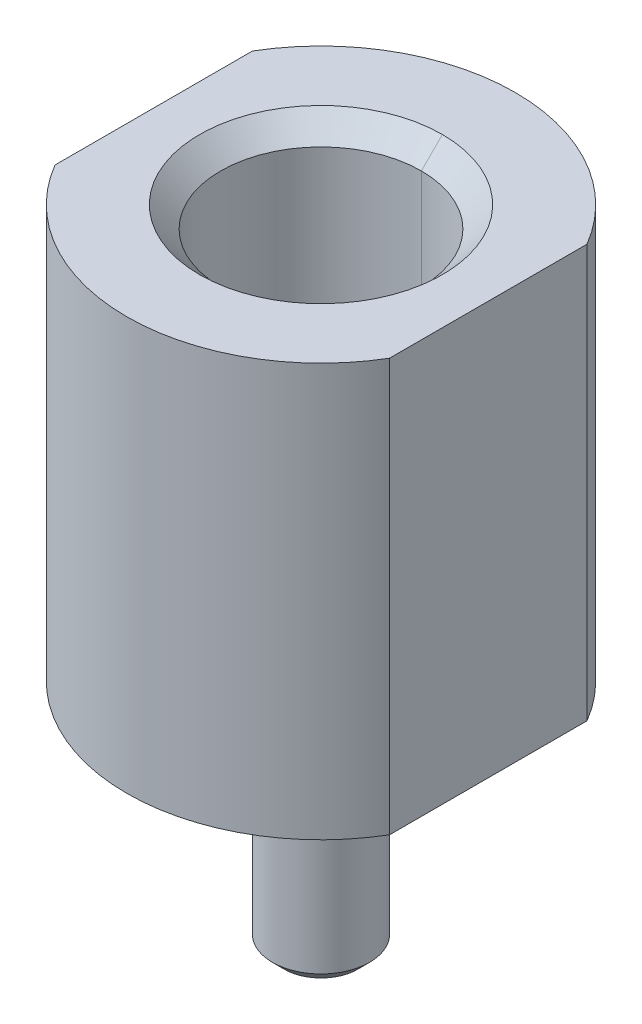
ISO-10303-21;
HEADER;
FILE_DESCRIPTION(('STEP AP214'),'2;1');
FILE_NAME('part.step','',(''),(''),'','','');
FILE_SCHEMA(('AUTOMOTIVE_DESIGN { 1 0 10303 214 1 1 1 1 }'));
ENDSEC;
DATA;
#1=APPLICATION_CONTEXT('core data for automotive mechanical design processes');
#2=APPLICATION_PROTOCOL_DEFINITION('international standard','automotive_design',2000,#1);
#3=PRODUCT_CONTEXT('',#1,'mechanical');
#4=PRODUCT('Part','Part','',(#3));
#5=PRODUCT_RELATED_PRODUCT_CATEGORY('part','',(#4));
#6=PRODUCT_DEFINITION_FORMATION('','',#4);
#7=PRODUCT_DEFINITION_CONTEXT('part definition',#1,'design');
#8=PRODUCT_DEFINITION('design','',#6,#7);
#9=PRODUCT_DEFINITION_SHAPE('','',#8);
#10=(LENGTH_UNIT() NAMED_UNIT(*) SI_UNIT(.MILLI.,.METRE.));
#11=(NAMED_UNIT(*) PLANE_ANGLE_UNIT() SI_UNIT($,.RADIAN.));
#12=(NAMED_UNIT(*) SI_UNIT($,.STERADIAN.) SOLID_ANGLE_UNIT());
#13=UNCERTAINTY_MEASURE_WITH_UNIT(LENGTH_MEASURE(1.E-05),#10,'distance_accuracy_value','');
#14=(GEOMETRIC_REPRESENTATION_CONTEXT(3) GLOBAL_UNCERTAINTY_ASSIGNED_CONTEXT((#13)) GLOBAL_UNIT_ASSIGNED_CONTEXT((#10,
#11,#12)) REPRESENTATION_CONTEXT('',''));
#15=CARTESIAN_POINT('',(0.,0.,0.));
#16=DIRECTION('',(0.,0.,1.));
#17=DIRECTION('',(1.,0.,0.));
#18=AXIS2_PLACEMENT_3D('',#15,#16,#17);
#19=CARTESIAN_POINT('',(0.,-13.26,0.));
#20=DIRECTION('',(0.,1.,0.));
#21=DIRECTION('',(0.,0.,1.));
#22=AXIS2_PLACEMENT_3D('',#19,#20,#21);
#23=CYLINDRICAL_SURFACE('',#22,4.);
#24=DIRECTION('',(0.,-1.,0.));
#25=VECTOR('',#24,1.);
#26=CARTESIAN_POINT('',(3.445,-13.26,-2.03272600219508));
#27=LINE('',#26,#25);
#28=CARTESIAN_POINT('',(3.445,0.,-2.03272600219508));
#29=VERTEX_POINT('',#28);
#30=CARTESIAN_POINT('',(3.445,-8.5,-2.03272600219508));
#31=VERTEX_POINT('',#30);
#32=EDGE_CURVE('E12',#29,#31,#27,.T.);
#33=ORIENTED_EDGE('',*,*,#32,.T.);
#34=CARTESIAN_POINT('',(0.,-8.5,0.));
#35=DIRECTION('',(0.,-1.,0.));
#36=DIRECTION('',(0.,0.,-1.));
#37=AXIS2_PLACEMENT_3D('',#34,#35,#36);
#38=CIRCLE('',#37,4.);
#39=CARTESIAN_POINT('',(-3.445,-8.5,-2.03272600219508));
#40=VERTEX_POINT('',#39);
#41=EDGE_CURVE('E53',#40,#31,#38,.T.);
#42=ORIENTED_EDGE('',*,*,#41,.F.);
#43=DIRECTION('',(0.,-1.,0.));
#44=VECTOR('',#43,1.);
#45=CARTESIAN_POINT('',(-3.445,-13.26,-2.03272600219508));
#46=LINE('',#45,#44);
#47=CARTESIAN_POINT('',(-3.445,0.,-2.03272600219508));
#48=VERTEX_POINT('',#47);
#49=EDGE_CURVE('E397',#48,#40,#46,.T.);
#50=ORIENTED_EDGE('',*,*,#49,.F.);
#51=CARTESIAN_POINT('',(0.,0.,0.));
#52=DIRECTION('',(0.,-1.,0.));
#53=DIRECTION('',(0.,0.,-1.));
#54=AXIS2_PLACEMENT_3D('',#51,#52,#53);
#55=CIRCLE('',#54,4.);
#56=EDGE_CURVE('E392',#48,#29,#55,.T.);
#57=ORIENTED_EDGE('',*,*,#56,.T.);
#58=EDGE_LOOP('',(#33,#42,#50,#57));
#59=FACE_BOUND('',#58,.T.);
#60=ADVANCED_FACE('F42',(#59),#23,.T.);
#61=CARTESIAN_POINT('',(2.5,0.,0.));
#62=DIRECTION('',(0.,-1.,0.));
#63=DIRECTION('',(0.,0.,-1.));
#64=AXIS2_PLACEMENT_3D('',#61,#62,#63);
#65=PLANE('',#64);
#66=DIRECTION('',(0.,0.,-1.));
#67=VECTOR('',#66,1.);
#68=CARTESIAN_POINT('',(3.445,0.,5.));
#69=LINE('',#68,#67);
#70=CARTESIAN_POINT('',(3.445,0.,2.03272600219508));
#71=VERTEX_POINT('',#70);
#72=EDGE_CURVE('E386',#71,#29,#69,.T.);
#73=ORIENTED_EDGE('',*,*,#72,.T.);
#74=ORIENTED_EDGE('',*,*,#56,.F.);
#75=DIRECTION('',(0.,0.,1.));
#76=VECTOR('',#75,1.);
#77=CARTESIAN_POINT('',(-3.445,0.,-5.));
#78=LINE('',#77,#76);
#79=CARTESIAN_POINT('',(-3.445,0.,2.03272600219508));
#80=VERTEX_POINT('',#79);
#81=EDGE_CURVE('E381',#48,#80,#78,.T.);
#82=ORIENTED_EDGE('',*,*,#81,.T.);
#83=CARTESIAN_POINT('',(0.,0.,0.));
#84=DIRECTION('',(0.,-1.,0.));
#85=DIRECTION('',(0.,0.,-1.));
#86=AXIS2_PLACEMENT_3D('',#83,#84,#85);
#87=CIRCLE('',#86,4.);
#88=EDGE_CURVE('E375',#71,#80,#87,.T.);
#89=ORIENTED_EDGE('',*,*,#88,.F.);
#90=EDGE_LOOP('',(#73,#74,#82,#89));
#91=FACE_BOUND('',#90,.T.);
#92=CARTESIAN_POINT('',(0.,0.,0.));
#93=DIRECTION('',(0.,-1.,0.));
#94=DIRECTION('',(0.,0.,-1.));
#95=AXIS2_PLACEMENT_3D('',#92,#93,#94);
#96=CIRCLE('',#95,2.5);
#97=CARTESIAN_POINT('',(0.,0.,-2.5));
#98=VERTEX_POINT('',#97);
#99=CARTESIAN_POINT('',(0.,0.,2.5));
#100=VERTEX_POINT('',#99);
#101=EDGE_CURVE('E370',#98,#100,#96,.T.);
#102=ORIENTED_EDGE('',*,*,#101,.T.);
#103=CARTESIAN_POINT('',(0.,0.,0.));
#104=DIRECTION('',(0.,-1.,0.));
#105=DIRECTION('',(0.,0.,-1.));
#106=AXIS2_PLACEMENT_3D('',#103,#104,#105);
#107=CIRCLE('',#106,2.5);
#108=EDGE_CURVE('E367',#100,#98,#107,.T.);
#109=ORIENTED_EDGE('',*,*,#108,.T.);
#110=EDGE_LOOP('',(#102,#109));
#111=FACE_BOUND('',#110,.T.);
#112=ADVANCED_FACE('F487',(#91,#111),#65,.F.);
#113=CARTESIAN_POINT('',(0.,-0.433000000000001,0.));
#114=DIRECTION('',(0.,1.,0.));
#115=DIRECTION('',(1.,0.,0.));
#116=AXIS2_PLACEMENT_3D('',#113,#114,#115);
#117=CONICAL_SURFACE('',#116,2.067,0.785398163397447);
#118=ORIENTED_EDGE('',*,*,#108,.F.);
#119=CARTESIAN_POINT('',(0.,-0.433000000000001,2.067));
#120=DIRECTION('',(0.,0.707106781186548,0.707106781186547));
#121=VECTOR('',#120,1.);
#122=LINE('',#119,#121);
#123=CARTESIAN_POINT('',(0.,-0.433000000000001,2.067));
#124=VERTEX_POINT('',#123);
#125=EDGE_CURVE('E335',#124,#100,#122,.T.);
#126=ORIENTED_EDGE('',*,*,#125,.F.);
#127=CARTESIAN_POINT('',(0.,-0.433000000000001,0.));
#128=DIRECTION('',(0.,-1.,0.));
#129=DIRECTION('',(0.,0.,-1.));
#130=AXIS2_PLACEMENT_3D('',#127,#128,#129);
#131=CIRCLE('',#130,2.067);
#132=CARTESIAN_POINT('',(0.,-0.433000000000001,-2.067));
#133=VERTEX_POINT('',#132);
#134=EDGE_CURVE('E353',#124,#133,#131,.T.);
#135=ORIENTED_EDGE('',*,*,#134,.T.);
#136=CARTESIAN_POINT('',(0.,-0.433000000000001,-2.067));
#137=DIRECTION('',(0.,0.707106781186548,-0.707106781186546));
#138=VECTOR('',#137,1.);
#139=LINE('',#136,#138);
#140=EDGE_CURVE('E338',#133,#98,#139,.T.);
#141=ORIENTED_EDGE('',*,*,#140,.T.);
#142=EDGE_LOOP('',(#118,#126,#135,#141));
#143=FACE_BOUND('',#142,.T.);
#144=ADVANCED_FACE('F319',(#143),#117,.F.);
#145=CARTESIAN_POINT('',(0.,-0.433000000000001,0.));
#146=DIRECTION('',(0.,1.,0.));
#147=DIRECTION('',(-1.,0.,0.));
#148=AXIS2_PLACEMENT_3D('',#145,#146,#147);
#149=CONICAL_SURFACE('',#148,2.067,0.785398163397447);
#150=CARTESIAN_POINT('',(0.,-0.433000000000001,0.));
#151=DIRECTION('',(0.,-1.,0.));
#152=DIRECTION('',(0.,0.,-1.));
#153=AXIS2_PLACEMENT_3D('',#150,#151,#152);
#154=CIRCLE('',#153,2.067);
#155=EDGE_CURVE('E302',#133,#124,#154,.T.);
#156=ORIENTED_EDGE('',*,*,#155,.T.);
#157=ORIENTED_EDGE('',*,*,#125,.T.);
#158=ORIENTED_EDGE('',*,*,#101,.F.);
#159=ORIENTED_EDGE('',*,*,#140,.F.);
#160=EDGE_LOOP('',(#156,#157,#158,#159));
#161=FACE_BOUND('',#160,.T.);
#162=ADVANCED_FACE('F310',(#161),#149,.F.);
#163=CARTESIAN_POINT('',(0.,-13.26,0.));
#164=DIRECTION('',(0.,1.,0.));
#165=DIRECTION('',(-1.,0.,0.));
#166=AXIS2_PLACEMENT_3D('',#163,#164,#165);
#167=CYLINDRICAL_SURFACE('',#166,2.067);
#168=CARTESIAN_POINT('',(0.,-3.93,0.));
#169=DIRECTION('',(0.,-1.,0.));
#170=DIRECTION('',(0.,0.,-1.));
#171=AXIS2_PLACEMENT_3D('',#168,#169,#170);
#172=CIRCLE('',#171,2.067);
#173=CARTESIAN_POINT('',(0.,-3.93,-2.067));
#174=VERTEX_POINT('',#173);
#175=CARTESIAN_POINT('',(0.,-3.93,2.067));
#176=VERTEX_POINT('',#175);
#177=EDGE_CURVE('E299',#174,#176,#172,.T.);
#178=ORIENTED_EDGE('',*,*,#177,.T.);
#179=CARTESIAN_POINT('',(0.,-3.93,2.067));
#180=DIRECTION('',(0.,1.,0.));
#181=VECTOR('',#180,1.);
#182=LINE('',#179,#181);
#183=EDGE_CURVE('E276',#176,#124,#182,.T.);
#184=ORIENTED_EDGE('',*,*,#183,.T.);
#185=ORIENTED_EDGE('',*,*,#155,.F.);
#186=CARTESIAN_POINT('',(0.,-3.93,-2.067));
#187=DIRECTION('',(0.,1.,0.));
#188=VECTOR('',#187,1.);
#189=LINE('',#186,#188);
#190=EDGE_CURVE('E289',#174,#133,#189,.T.);
#191=ORIENTED_EDGE('',*,*,#190,.F.);
#192=EDGE_LOOP('',(#178,#184,#185,#191));
#193=FACE_BOUND('',#192,.T.);
#194=ADVANCED_FACE('F254',(#193),#167,.F.);
#195=CARTESIAN_POINT('',(0.,-13.26,0.));
#196=DIRECTION('',(0.,1.,0.));
#197=DIRECTION('',(1.,0.,0.));
#198=AXIS2_PLACEMENT_3D('',#195,#196,#197);
#199=CYLINDRICAL_SURFACE('',#198,2.067);
#200=ORIENTED_EDGE('',*,*,#134,.F.);
#201=ORIENTED_EDGE('',*,*,#183,.F.);
#202=CARTESIAN_POINT('',(0.,-3.93,0.));
#203=DIRECTION('',(0.,-1.,0.));
#204=DIRECTION('',(0.,0.,-1.));
#205=AXIS2_PLACEMENT_3D('',#202,#203,#204);
#206=CIRCLE('',#205,2.067);
#207=EDGE_CURVE('E234',#176,#174,#206,.T.);
#208=ORIENTED_EDGE('',*,*,#207,.T.);
#209=ORIENTED_EDGE('',*,*,#190,.T.);
#210=EDGE_LOOP('',(#200,#201,#208,#209));
#211=FACE_BOUND('',#210,.T.);
#212=ADVANCED_FACE('F243',(#211),#199,.F.);
#213=CARTESIAN_POINT('',(0.,-3.93,0.));
#214=DIRECTION('',(0.,-1.,0.));
#215=DIRECTION('',(0.,0.,-1.));
#216=AXIS2_PLACEMENT_3D('',#213,#214,#215);
#217=PLANE('',#216);
#218=ORIENTED_EDGE('',*,*,#177,.F.);
#219=ORIENTED_EDGE('',*,*,#207,.F.);
#220=EDGE_LOOP('',(#218,#219));
#221=FACE_BOUND('',#220,.T.);
#222=ADVANCED_FACE('F253',(#221),#217,.F.);
#223=CARTESIAN_POINT('',(0.,-13.26,0.));
#224=DIRECTION('',(0.,1.,0.));
#225=DIRECTION('',(0.,0.,-1.));
#226=AXIS2_PLACEMENT_3D('',#223,#224,#225);
#227=CYLINDRICAL_SURFACE('',#226,4.);
#228=DIRECTION('',(0.,-1.,0.));
#229=VECTOR('',#228,1.);
#230=CARTESIAN_POINT('',(3.445,-13.26,2.03272600219508));
#231=LINE('',#230,#229);
#232=CARTESIAN_POINT('',(3.445,-8.5,2.03272600219508));
#233=VERTEX_POINT('',#232);
#234=EDGE_CURVE('E228',#71,#233,#231,.T.);
#235=ORIENTED_EDGE('',*,*,#234,.F.);
#236=ORIENTED_EDGE('',*,*,#88,.T.);
#237=DIRECTION('',(0.,-1.,0.));
#238=VECTOR('',#237,1.);
#239=CARTESIAN_POINT('',(-3.445,-13.26,2.03272600219508));
#240=LINE('',#239,#238);
#241=CARTESIAN_POINT('',(-3.445,-8.5,2.03272600219508));
#242=VERTEX_POINT('',#241);
#243=EDGE_CURVE('E223',#80,#242,#240,.T.);
#244=ORIENTED_EDGE('',*,*,#243,.T.);
#245=CARTESIAN_POINT('',(0.,-8.5,0.));
#246=DIRECTION('',(0.,-1.,0.));
#247=DIRECTION('',(0.,0.,-1.));
#248=AXIS2_PLACEMENT_3D('',#245,#246,#247);
#249=CIRCLE('',#248,4.);
#250=EDGE_CURVE('E204',#233,#242,#249,.T.);
#251=ORIENTED_EDGE('',*,*,#250,.F.);
#252=EDGE_LOOP('',(#235,#236,#244,#251));
#253=FACE_BOUND('',#252,.T.);
#254=ADVANCED_FACE('F502',(#253),#227,.T.);
#255=CARTESIAN_POINT('',(4.,-8.5,0.));
#256=DIRECTION('',(0.,1.,0.));
#257=DIRECTION('',(0.,0.,1.));
#258=AXIS2_PLACEMENT_3D('',#255,#256,#257);
#259=PLANE('',#258);
#260=CARTESIAN_POINT('',(0.,-8.5,0.));
#261=DIRECTION('',(0.,-1.,0.));
#262=DIRECTION('',(0.,0.,-1.));
#263=AXIS2_PLACEMENT_3D('',#260,#261,#262);
#264=CIRCLE('',#263,1.);
#265=CARTESIAN_POINT('',(0.,-8.5,-1.));
#266=VERTEX_POINT('',#265);
#267=CARTESIAN_POINT('',(0.,-8.5,1.));
#268=VERTEX_POINT('',#267);
#269=EDGE_CURVE('E195',#266,#268,#264,.T.);
#270=ORIENTED_EDGE('',*,*,#269,.F.);
#271=CARTESIAN_POINT('',(0.,-8.5,0.));
#272=DIRECTION('',(0.,-1.,0.));
#273=DIRECTION('',(0.,0.,-1.));
#274=AXIS2_PLACEMENT_3D('',#271,#272,#273);
#275=CIRCLE('',#274,1.);
#276=EDGE_CURVE('E202',#268,#266,#275,.T.);
#277=ORIENTED_EDGE('',*,*,#276,.F.);
#278=EDGE_LOOP('',(#270,#277));
#279=FACE_BOUND('',#278,.T.);
#280=DIRECTION('',(0.,0.,-1.));
#281=VECTOR('',#280,1.);
#282=CARTESIAN_POINT('',(3.445,-8.5,0.));
#283=LINE('',#282,#281);
#284=EDGE_CURVE('E208',#233,#31,#283,.T.);
#285=ORIENTED_EDGE('',*,*,#284,.F.);
#286=ORIENTED_EDGE('',*,*,#250,.T.);
#287=DIRECTION('',(0.,0.,1.));
#288=VECTOR('',#287,1.);
#289=CARTESIAN_POINT('',(-3.445,-8.5,0.));
#290=LINE('',#289,#288);
#291=EDGE_CURVE('E197',#40,#242,#290,.T.);
#292=ORIENTED_EDGE('',*,*,#291,.F.);
#293=ORIENTED_EDGE('',*,*,#41,.T.);
#294=EDGE_LOOP('',(#285,#286,#292,#293));
#295=FACE_BOUND('',#294,.T.);
#296=ADVANCED_FACE('F200',(#279,#295),#259,.F.);
#297=CARTESIAN_POINT('',(-3.445,-8.5,-5.));
#298=DIRECTION('',(-1.,0.,0.));
#299=DIRECTION('',(0.,0.,1.));
#300=AXIS2_PLACEMENT_3D('',#297,#298,#299);
#301=PLANE('',#300);
#302=ORIENTED_EDGE('',*,*,#49,.T.);
#303=ORIENTED_EDGE('',*,*,#291,.T.);
#304=ORIENTED_EDGE('',*,*,#243,.F.);
#305=ORIENTED_EDGE('',*,*,#81,.F.);
#306=EDGE_LOOP('',(#302,#303,#304,#305));
#307=FACE_BOUND('',#306,.T.);
#308=ADVANCED_FACE('F505',(#307),#301,.T.);
#309=CARTESIAN_POINT('',(3.445,-8.5,5.));
#310=DIRECTION('',(1.,0.,0.));
#311=DIRECTION('',(0.,0.,-1.));
#312=AXIS2_PLACEMENT_3D('',#309,#310,#311);
#313=PLANE('',#312);
#314=ORIENTED_EDGE('',*,*,#234,.T.);
#315=ORIENTED_EDGE('',*,*,#284,.T.);
#316=ORIENTED_EDGE('',*,*,#32,.F.);
#317=ORIENTED_EDGE('',*,*,#72,.F.);
#318=EDGE_LOOP('',(#314,#315,#316,#317));
#319=FACE_BOUND('',#318,.T.);
#320=ADVANCED_FACE('F160',(#319),#313,.T.);
#321=CARTESIAN_POINT('',(0.,-13.26,0.));
#322=DIRECTION('',(0.,1.,0.));
#323=DIRECTION('',(1.,0.,0.));
#324=AXIS2_PLACEMENT_3D('',#321,#322,#323);
#325=CYLINDRICAL_SURFACE('',#324,1.);
#326=CARTESIAN_POINT('',(0.,-8.66,1.));
#327=DIRECTION('',(0.,1.,0.));
#328=VECTOR('',#327,1.);
#329=LINE('',#326,#328);
#330=CARTESIAN_POINT('',(0.,-8.66,1.));
#331=VERTEX_POINT('',#330);
#332=EDGE_CURVE('E60',#331,#268,#329,.T.);
#333=ORIENTED_EDGE('',*,*,#332,.F.);
#334=ORIENTED_EDGE('',*,*,#332,.T.);
#335=ORIENTED_EDGE('',*,*,#276,.T.);
#336=CARTESIAN_POINT('',(0.,-8.66,-1.));
#337=DIRECTION('',(0.,1.,0.));
#338=VECTOR('',#337,1.);
#339=LINE('',#336,#338);
#340=CARTESIAN_POINT('',(0.,-8.66,-1.));
#341=VERTEX_POINT('',#340);
#342=EDGE_CURVE('E66',#341,#266,#339,.T.);
#343=ORIENTED_EDGE('',*,*,#342,.F.);
#344=ORIENTED_EDGE('',*,*,#342,.T.);
#345=ORIENTED_EDGE('',*,*,#269,.T.);
#346=EDGE_LOOP('',(#333,#334,#335,#343,#344,#345));
#347=FACE_BOUND('',#346,.T.);
#348=CARTESIAN_POINT('',(0.,-13.0145,0.));
#349=DIRECTION('',(0.,-1.,0.));
#350=DIRECTION('',(0.,0.,-1.));
#351=AXIS2_PLACEMENT_3D('',#348,#349,#350);
#352=CIRCLE('',#351,1.);
#353=CARTESIAN_POINT('',(0.,-13.0145,-1.));
#354=VERTEX_POINT('',#353);
#355=CARTESIAN_POINT('',(0.,-13.0145,1.));
#356=VERTEX_POINT('',#355);
#357=EDGE_CURVE('E412',#354,#356,#352,.T.);
#358=ORIENTED_EDGE('',*,*,#357,.F.);
#359=CARTESIAN_POINT('',(0.,-13.0145,-1.));
#360=DIRECTION('',(0.,1.,0.));
#361=VECTOR('',#360,1.);
#362=LINE('',#359,#361);
#363=CARTESIAN_POINT('',(0.,-11.66,-1.));
#364=VERTEX_POINT('',#363);
#365=EDGE_CURVE('E141',#354,#364,#362,.T.);
#366=ORIENTED_EDGE('',*,*,#365,.T.);
#367=ORIENTED_EDGE('',*,*,#365,.F.);
#368=CARTESIAN_POINT('',(0.,-13.0145,0.));
#369=DIRECTION('',(0.,-1.,0.));
#370=DIRECTION('',(0.,0.,-1.));
#371=AXIS2_PLACEMENT_3D('',#368,#369,#370);
#372=CIRCLE('',#371,1.);
#373=EDGE_CURVE('E138',#356,#354,#372,.T.);
#374=ORIENTED_EDGE('',*,*,#373,.F.);
#375=CARTESIAN_POINT('',(0.,-13.0145,1.));
#376=DIRECTION('',(0.,1.,0.));
#377=VECTOR('',#376,1.);
#378=LINE('',#375,#377);
#379=CARTESIAN_POINT('',(0.,-11.66,1.));
#380=VERTEX_POINT('',#379);
#381=EDGE_CURVE('E132',#356,#380,#378,.T.);
#382=ORIENTED_EDGE('',*,*,#381,.T.);
#383=ORIENTED_EDGE('',*,*,#381,.F.);
#384=EDGE_LOOP('',(#358,#366,#367,#374,#382,#383));
#385=FACE_BOUND('',#384,.T.);
#386=ADVANCED_FACE('F134',(#347,#385),#325,.T.);
#387=CARTESIAN_POINT('',(0.7545,-13.26,0.));
#388=DIRECTION('',(0.,1.,0.));
#389=DIRECTION('',(0.,0.,1.));
#390=AXIS2_PLACEMENT_3D('',#387,#388,#389);
#391=PLANE('',#390);
#392=CARTESIAN_POINT('',(0.,-13.26,0.));
#393=DIRECTION('',(0.,-1.,0.));
#394=DIRECTION('',(0.,0.,-1.));
#395=AXIS2_PLACEMENT_3D('',#392,#393,#394);
#396=CIRCLE('',#395,0.7545);
#397=CARTESIAN_POINT('',(0.,-13.26,-0.7545));
#398=VERTEX_POINT('',#397);
#399=CARTESIAN_POINT('',(0.,-13.26,0.7545));
#400=VERTEX_POINT('',#399);
#401=EDGE_CURVE('E456',#398,#400,#396,.T.);
#402=ORIENTED_EDGE('',*,*,#401,.T.);
#403=CARTESIAN_POINT('',(0.,-13.26,0.));
#404=DIRECTION('',(0.,-1.,0.));
#405=DIRECTION('',(0.,0.,-1.));
#406=AXIS2_PLACEMENT_3D('',#403,#404,#405);
#407=CIRCLE('',#406,0.7545);
#408=EDGE_CURVE('E440',#400,#398,#407,.T.);
#409=ORIENTED_EDGE('',*,*,#408,.T.);
#410=EDGE_LOOP('',(#402,#409));
#411=FACE_BOUND('',#410,.T.);
#412=ADVANCED_FACE('F159',(#411),#391,.F.);
#413=CARTESIAN_POINT('',(0.,-13.0145,0.));
#414=DIRECTION('',(0.,1.,0.));
#415=DIRECTION('',(-1.,0.,0.));
#416=AXIS2_PLACEMENT_3D('',#413,#414,#415);
#417=CONICAL_SURFACE('',#416,1.,0.785398163397447);
#418=ORIENTED_EDGE('',*,*,#401,.F.);
#419=CARTESIAN_POINT('',(0.,-13.26,-0.7545));
#420=DIRECTION('',(0.,0.707106781186549,-0.707106781186546));
#421=VECTOR('',#420,1.);
#422=LINE('',#419,#421);
#423=EDGE_CURVE('E426',#398,#354,#422,.T.);
#424=ORIENTED_EDGE('',*,*,#423,.T.);
#425=ORIENTED_EDGE('',*,*,#357,.T.);
#426=CARTESIAN_POINT('',(0.,-13.26,0.7545));
#427=DIRECTION('',(0.,0.707106781186549,0.707106781186546));
#428=VECTOR('',#427,1.);
#429=LINE('',#426,#428);
#430=EDGE_CURVE('E444',#400,#356,#429,.T.);
#431=ORIENTED_EDGE('',*,*,#430,.F.);
#432=EDGE_LOOP('',(#418,#424,#425,#431));
#433=FACE_BOUND('',#432,.T.);
#434=ADVANCED_FACE('F465',(#433),#417,.T.);
#435=CARTESIAN_POINT('',(0.,-13.0145,0.));
#436=DIRECTION('',(0.,1.,0.));
#437=DIRECTION('',(1.,0.,0.));
#438=AXIS2_PLACEMENT_3D('',#435,#436,#437);
#439=CONICAL_SURFACE('',#438,1.,0.785398163397447);
#440=ORIENTED_EDGE('',*,*,#373,.T.);
#441=ORIENTED_EDGE('',*,*,#423,.F.);
#442=ORIENTED_EDGE('',*,*,#408,.F.);
#443=ORIENTED_EDGE('',*,*,#430,.T.);
#444=EDGE_LOOP('',(#440,#441,#442,#443));
#445=FACE_BOUND('',#444,.T.);
#446=ADVANCED_FACE('F161',(#445),#439,.T.);
#447=CLOSED_SHELL('',(#60,#112,#144,#162,#194,#212,#222,#254,#296,#308,#320,#386,#412,#434,#446));
#448=MANIFOLD_SOLID_BREP('B2',#447);
#449=ADVANCED_BREP_SHAPE_REPRESENTATION('',(#18,#448),#14);
#450=SHAPE_DEFINITION_REPRESENTATION(#9,#449);
ENDSEC;
END-ISO-10303-21;
